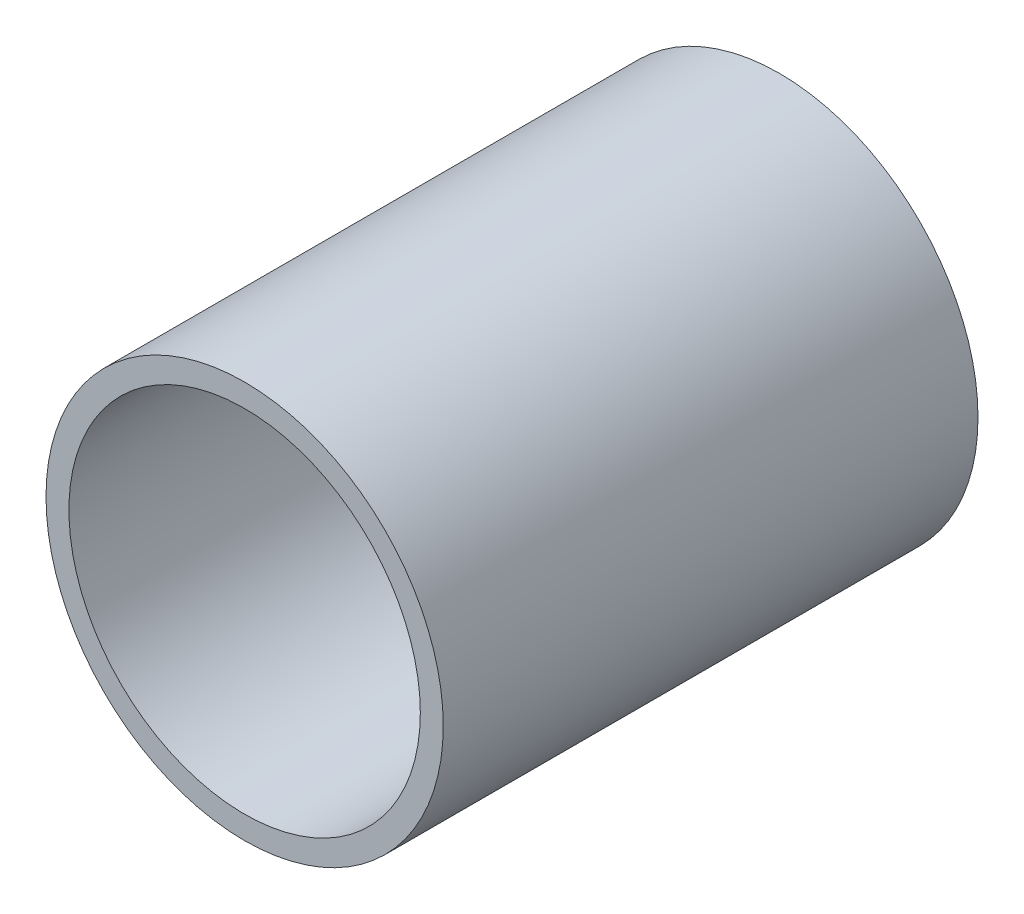
ISO-10303-21;
HEADER;
FILE_DESCRIPTION(('STEP AP214'),'2;1');
FILE_NAME('part.step','',(''),(''),'','','');
FILE_SCHEMA(('AUTOMOTIVE_DESIGN { 1 0 10303 214 1 1 1 1 }'));
ENDSEC;
DATA;
#1=APPLICATION_CONTEXT('core data for automotive mechanical design processes');
#2=APPLICATION_PROTOCOL_DEFINITION('international standard','automotive_design',2000,#1);
#3=PRODUCT_CONTEXT('',#1,'mechanical');
#4=PRODUCT('Part','Part','',(#3));
#5=PRODUCT_RELATED_PRODUCT_CATEGORY('part','',(#4));
#6=PRODUCT_DEFINITION_FORMATION('','',#4);
#7=PRODUCT_DEFINITION_CONTEXT('part definition',#1,'design');
#8=PRODUCT_DEFINITION('design','',#6,#7);
#9=PRODUCT_DEFINITION_SHAPE('','',#8);
#10=(LENGTH_UNIT() NAMED_UNIT(*) SI_UNIT(.MILLI.,.METRE.));
#11=(NAMED_UNIT(*) PLANE_ANGLE_UNIT() SI_UNIT($,.RADIAN.));
#12=(NAMED_UNIT(*) SI_UNIT($,.STERADIAN.) SOLID_ANGLE_UNIT());
#13=UNCERTAINTY_MEASURE_WITH_UNIT(LENGTH_MEASURE(1.E-05),#10,'distance_accuracy_value','');
#14=(GEOMETRIC_REPRESENTATION_CONTEXT(3) GLOBAL_UNCERTAINTY_ASSIGNED_CONTEXT((#13)) GLOBAL_UNIT_ASSIGNED_CONTEXT((#10,
#11,#12)) REPRESENTATION_CONTEXT('',''));
#15=CARTESIAN_POINT('',(0.,0.,0.));
#16=DIRECTION('',(0.,0.,1.));
#17=DIRECTION('',(1.,0.,0.));
#18=AXIS2_PLACEMENT_3D('',#15,#16,#17);
#19=CARTESIAN_POINT('',(26.,0.,0.));
#20=DIRECTION('',(0.,0.,1.));
#21=DIRECTION('',(1.,0.,0.));
#22=AXIS2_PLACEMENT_3D('',#19,#20,#21);
#23=PLANE('',#22);
#24=CARTESIAN_POINT('',(0.,0.,0.));
#25=DIRECTION('',(0.,0.,1.));
#26=DIRECTION('',(1.,0.,0.));
#27=AXIS2_PLACEMENT_3D('',#24,#25,#26);
#28=CIRCLE('',#27,26.);
#29=CARTESIAN_POINT('',(26.,0.,0.));
#30=VERTEX_POINT('',#29);
#31=EDGE_CURVE('E49',#30,#30,#28,.T.);
#32=ORIENTED_EDGE('',*,*,#31,.T.);
#33=EDGE_LOOP('',(#32));
#34=FACE_BOUND('',#33,.T.);
#35=CARTESIAN_POINT('',(0.,0.,0.));
#36=DIRECTION('',(0.,0.,1.));
#37=DIRECTION('',(1.,0.,0.));
#38=AXIS2_PLACEMENT_3D('',#35,#36,#37);
#39=CIRCLE('',#38,23.);
#40=CARTESIAN_POINT('',(23.,0.,0.));
#41=VERTEX_POINT('',#40);
#42=EDGE_CURVE('E10',#41,#41,#39,.T.);
#43=ORIENTED_EDGE('',*,*,#42,.F.);
#44=EDGE_LOOP('',(#43));
#45=FACE_BOUND('',#44,.T.);
#46=ADVANCED_FACE('F35',(#34,#45),#23,.T.);
#47=CARTESIAN_POINT('',(0.,0.,0.));
#48=DIRECTION('',(0.,0.,1.));
#49=DIRECTION('',(1.,0.,0.));
#50=AXIS2_PLACEMENT_3D('',#47,#48,#49);
#51=CYLINDRICAL_SURFACE('',#50,23.);
#52=ORIENTED_EDGE('',*,*,#42,.T.);
#53=EDGE_LOOP('',(#52));
#54=FACE_BOUND('',#53,.T.);
#55=CARTESIAN_POINT('',(0.,0.,-70.));
#56=DIRECTION('',(0.,0.,1.));
#57=DIRECTION('',(1.,0.,0.));
#58=AXIS2_PLACEMENT_3D('',#55,#56,#57);
#59=CIRCLE('',#58,23.);
#60=CARTESIAN_POINT('',(23.,0.,-70.));
#61=VERTEX_POINT('',#60);
#62=EDGE_CURVE('E41',#61,#61,#59,.T.);
#63=ORIENTED_EDGE('',*,*,#62,.F.);
#64=EDGE_LOOP('',(#63));
#65=FACE_BOUND('',#64,.T.);
#66=ADVANCED_FACE('F65',(#54,#65),#51,.F.);
#67=CARTESIAN_POINT('',(23.,0.,-70.));
#68=DIRECTION('',(0.,0.,-1.));
#69=DIRECTION('',(-1.,0.,0.));
#70=AXIS2_PLACEMENT_3D('',#67,#68,#69);
#71=PLANE('',#70);
#72=ORIENTED_EDGE('',*,*,#62,.T.);
#73=EDGE_LOOP('',(#72));
#74=FACE_BOUND('',#73,.T.);
#75=CARTESIAN_POINT('',(0.,0.,-70.));
#76=DIRECTION('',(0.,0.,1.));
#77=DIRECTION('',(1.,0.,0.));
#78=AXIS2_PLACEMENT_3D('',#75,#76,#77);
#79=CIRCLE('',#78,26.);
#80=CARTESIAN_POINT('',(26.,0.,-70.));
#81=VERTEX_POINT('',#80);
#82=EDGE_CURVE('E45',#81,#81,#79,.T.);
#83=ORIENTED_EDGE('',*,*,#82,.F.);
#84=EDGE_LOOP('',(#83));
#85=FACE_BOUND('',#84,.T.);
#86=ADVANCED_FACE('F59',(#74,#85),#71,.T.);
#87=CARTESIAN_POINT('',(0.,0.,0.));
#88=DIRECTION('',(0.,0.,1.));
#89=DIRECTION('',(1.,0.,0.));
#90=AXIS2_PLACEMENT_3D('',#87,#88,#89);
#91=CYLINDRICAL_SURFACE('',#90,26.);
#92=ORIENTED_EDGE('',*,*,#82,.T.);
#93=EDGE_LOOP('',(#92));
#94=FACE_BOUND('',#93,.T.);
#95=ORIENTED_EDGE('',*,*,#31,.F.);
#96=EDGE_LOOP('',(#95));
#97=FACE_BOUND('',#96,.T.);
#98=ADVANCED_FACE('F57',(#94,#97),#91,.T.);
#99=CLOSED_SHELL('',(#46,#66,#86,#98));
#100=MANIFOLD_SOLID_BREP('B2',#99);
#101=ADVANCED_BREP_SHAPE_REPRESENTATION('',(#18,#100),#14);
#102=SHAPE_DEFINITION_REPRESENTATION(#9,#101);
ENDSEC;
END-ISO-10303-21;
